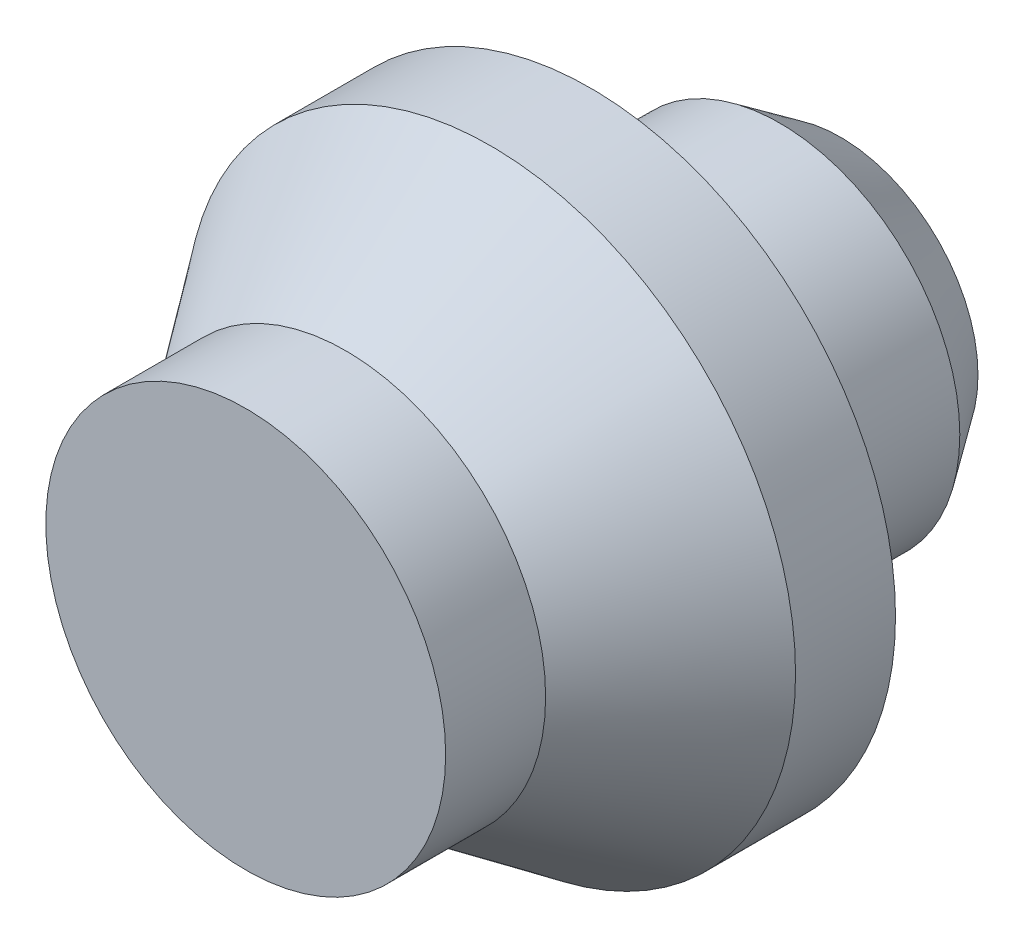
ISO-10303-21;
HEADER;
FILE_DESCRIPTION(('STEP AP214'),'2;1');
FILE_NAME('part.step','',(''),(''),'','','');
FILE_SCHEMA(('AUTOMOTIVE_DESIGN { 1 0 10303 214 1 1 1 1 }'));
ENDSEC;
DATA;
#1=APPLICATION_CONTEXT('core data for automotive mechanical design processes');
#2=APPLICATION_PROTOCOL_DEFINITION('international standard','automotive_design',2000,#1);
#3=PRODUCT_CONTEXT('',#1,'mechanical');
#4=PRODUCT('Part','Part','',(#3));
#5=PRODUCT_RELATED_PRODUCT_CATEGORY('part','',(#4));
#6=PRODUCT_DEFINITION_FORMATION('','',#4);
#7=PRODUCT_DEFINITION_CONTEXT('part definition',#1,'design');
#8=PRODUCT_DEFINITION('design','',#6,#7);
#9=PRODUCT_DEFINITION_SHAPE('','',#8);
#10=(LENGTH_UNIT() NAMED_UNIT(*) SI_UNIT(.MILLI.,.METRE.));
#11=(NAMED_UNIT(*) PLANE_ANGLE_UNIT() SI_UNIT($,.RADIAN.));
#12=(NAMED_UNIT(*) SI_UNIT($,.STERADIAN.) SOLID_ANGLE_UNIT());
#13=UNCERTAINTY_MEASURE_WITH_UNIT(LENGTH_MEASURE(1.E-05),#10,'distance_accuracy_value','');
#14=(GEOMETRIC_REPRESENTATION_CONTEXT(3) GLOBAL_UNCERTAINTY_ASSIGNED_CONTEXT((#13)) GLOBAL_UNIT_ASSIGNED_CONTEXT((#10,
#11,#12)) REPRESENTATION_CONTEXT('',''));
#15=CARTESIAN_POINT('',(0.,0.,0.));
#16=DIRECTION('',(0.,0.,1.));
#17=DIRECTION('',(1.,0.,0.));
#18=AXIS2_PLACEMENT_3D('',#15,#16,#17);
#19=CARTESIAN_POINT('',(4.,0.,0.));
#20=DIRECTION('',(0.,0.,1.));
#21=DIRECTION('',(1.,0.,0.));
#22=AXIS2_PLACEMENT_3D('',#19,#20,#21);
#23=PLANE('',#22);
#24=CARTESIAN_POINT('',(0.,0.,0.));
#25=DIRECTION('',(0.,0.,1.));
#26=DIRECTION('',(1.,0.,0.));
#27=AXIS2_PLACEMENT_3D('',#24,#25,#26);
#28=CIRCLE('',#27,4.);
#29=CARTESIAN_POINT('',(4.,0.,0.));
#30=VERTEX_POINT('',#29);
#31=EDGE_CURVE('E63',#30,#30,#28,.T.);
#32=ORIENTED_EDGE('',*,*,#31,.T.);
#33=EDGE_LOOP('',(#32));
#34=FACE_BOUND('',#33,.T.);
#35=ADVANCED_FACE('F32',(#34),#23,.T.);
#36=CARTESIAN_POINT('',(0.,0.,-11.9));
#37=DIRECTION('',(0.,0.,-1.));
#38=DIRECTION('',(-1.,0.,0.));
#39=AXIS2_PLACEMENT_3D('',#36,#37,#38);
#40=PLANE('',#39);
#41=CARTESIAN_POINT('',(0.,0.,-11.9));
#42=DIRECTION('',(0.,0.,1.));
#43=DIRECTION('',(1.,0.,0.));
#44=AXIS2_PLACEMENT_3D('',#41,#42,#43);
#45=CIRCLE('',#44,2.75);
#46=CARTESIAN_POINT('',(2.75,0.,-11.9));
#47=VERTEX_POINT('',#46);
#48=EDGE_CURVE('E10',#47,#47,#45,.T.);
#49=ORIENTED_EDGE('',*,*,#48,.F.);
#50=EDGE_LOOP('',(#49));
#51=FACE_BOUND('',#50,.T.);
#52=ADVANCED_FACE('F80',(#51),#40,.T.);
#53=CARTESIAN_POINT('',(0.,0.,-10.6860741942692));
#54=DIRECTION('',(0.,0.,1.));
#55=DIRECTION('',(1.,0.,0.));
#56=AXIS2_PLACEMENT_3D('',#53,#54,#55);
#57=CONICAL_SURFACE('',#56,3.6,0.610865238198018);
#58=ORIENTED_EDGE('',*,*,#48,.T.);
#59=EDGE_LOOP('',(#58));
#60=FACE_BOUND('',#59,.T.);
#61=CARTESIAN_POINT('',(0.,0.,-10.6860741942692));
#62=DIRECTION('',(0.,0.,1.));
#63=DIRECTION('',(1.,0.,0.));
#64=AXIS2_PLACEMENT_3D('',#61,#62,#63);
#65=CIRCLE('',#64,3.6);
#66=CARTESIAN_POINT('',(3.6,0.,-10.6860741942692));
#67=VERTEX_POINT('',#66);
#68=EDGE_CURVE('E39',#67,#67,#65,.T.);
#69=ORIENTED_EDGE('',*,*,#68,.F.);
#70=EDGE_LOOP('',(#69));
#71=FACE_BOUND('',#70,.T.);
#72=ADVANCED_FACE('F84',(#60,#71),#57,.T.);
#73=CARTESIAN_POINT('',(0.,0.,0.));
#74=DIRECTION('',(0.,0.,1.));
#75=DIRECTION('',(1.,0.,0.));
#76=AXIS2_PLACEMENT_3D('',#73,#74,#75);
#77=CYLINDRICAL_SURFACE('',#76,3.6);
#78=ORIENTED_EDGE('',*,*,#68,.T.);
#79=EDGE_LOOP('',(#78));
#80=FACE_BOUND('',#79,.T.);
#81=CARTESIAN_POINT('',(0.,0.,-6.9));
#82=DIRECTION('',(0.,0.,1.));
#83=DIRECTION('',(1.,0.,0.));
#84=AXIS2_PLACEMENT_3D('',#81,#82,#83);
#85=CIRCLE('',#84,3.6);
#86=CARTESIAN_POINT('',(3.6,0.,-6.9));
#87=VERTEX_POINT('',#86);
#88=EDGE_CURVE('E46',#87,#87,#85,.T.);
#89=ORIENTED_EDGE('',*,*,#88,.F.);
#90=EDGE_LOOP('',(#89));
#91=FACE_BOUND('',#90,.T.);
#92=ADVANCED_FACE('F89',(#80,#91),#77,.T.);
#93=CARTESIAN_POINT('',(3.6,0.,-6.9));
#94=DIRECTION('',(0.,0.,-1.));
#95=DIRECTION('',(-1.,0.,0.));
#96=AXIS2_PLACEMENT_3D('',#93,#94,#95);
#97=PLANE('',#96);
#98=ORIENTED_EDGE('',*,*,#88,.T.);
#99=EDGE_LOOP('',(#98));
#100=FACE_BOUND('',#99,.T.);
#101=CARTESIAN_POINT('',(0.,0.,-6.9));
#102=DIRECTION('',(0.,0.,1.));
#103=DIRECTION('',(1.,0.,0.));
#104=AXIS2_PLACEMENT_3D('',#101,#102,#103);
#105=CIRCLE('',#104,6.1);
#106=CARTESIAN_POINT('',(6.1,0.,-6.9));
#107=VERTEX_POINT('',#106);
#108=EDGE_CURVE('E51',#107,#107,#105,.T.);
#109=ORIENTED_EDGE('',*,*,#108,.F.);
#110=EDGE_LOOP('',(#109));
#111=FACE_BOUND('',#110,.T.);
#112=ADVANCED_FACE('F94',(#100,#111),#97,.T.);
#113=CARTESIAN_POINT('',(0.,0.,0.));
#114=DIRECTION('',(0.,0.,1.));
#115=DIRECTION('',(1.,0.,0.));
#116=AXIS2_PLACEMENT_3D('',#113,#114,#115);
#117=CYLINDRICAL_SURFACE('',#116,6.1);
#118=ORIENTED_EDGE('',*,*,#108,.T.);
#119=EDGE_LOOP('',(#118));
#120=FACE_BOUND('',#119,.T.);
#121=CARTESIAN_POINT('',(0.,0.,-4.9));
#122=DIRECTION('',(0.,0.,1.));
#123=DIRECTION('',(1.,0.,0.));
#124=AXIS2_PLACEMENT_3D('',#121,#122,#123);
#125=CIRCLE('',#124,6.1);
#126=CARTESIAN_POINT('',(6.1,0.,-4.9));
#127=VERTEX_POINT('',#126);
#128=EDGE_CURVE('E57',#127,#127,#125,.T.);
#129=ORIENTED_EDGE('',*,*,#128,.F.);
#130=EDGE_LOOP('',(#129));
#131=FACE_BOUND('',#130,.T.);
#132=ADVANCED_FACE('F76',(#120,#131),#117,.T.);
#133=CARTESIAN_POINT('',(0.,0.,-2.));
#134=DIRECTION('',(0.,0.,-1.));
#135=DIRECTION('',(-1.,0.,0.));
#136=AXIS2_PLACEMENT_3D('',#133,#134,#135);
#137=CONICAL_SURFACE('',#136,4.,0.626742901211047);
#138=ORIENTED_EDGE('',*,*,#128,.T.);
#139=EDGE_LOOP('',(#138));
#140=FACE_BOUND('',#139,.T.);
#141=CARTESIAN_POINT('',(0.,0.,-2.));
#142=DIRECTION('',(0.,0.,1.));
#143=DIRECTION('',(1.,0.,0.));
#144=AXIS2_PLACEMENT_3D('',#141,#142,#143);
#145=CIRCLE('',#144,4.);
#146=CARTESIAN_POINT('',(4.,0.,-2.));
#147=VERTEX_POINT('',#146);
#148=EDGE_CURVE('E60',#147,#147,#145,.T.);
#149=ORIENTED_EDGE('',*,*,#148,.F.);
#150=EDGE_LOOP('',(#149));
#151=FACE_BOUND('',#150,.T.);
#152=ADVANCED_FACE('F70',(#140,#151),#137,.T.);
#153=CARTESIAN_POINT('',(0.,0.,0.));
#154=DIRECTION('',(0.,0.,1.));
#155=DIRECTION('',(1.,0.,0.));
#156=AXIS2_PLACEMENT_3D('',#153,#154,#155);
#157=CYLINDRICAL_SURFACE('',#156,4.);
#158=ORIENTED_EDGE('',*,*,#148,.T.);
#159=EDGE_LOOP('',(#158));
#160=FACE_BOUND('',#159,.T.);
#161=ORIENTED_EDGE('',*,*,#31,.F.);
#162=EDGE_LOOP('',(#161));
#163=FACE_BOUND('',#162,.T.);
#164=ADVANCED_FACE('F68',(#160,#163),#157,.T.);
#165=CLOSED_SHELL('',(#35,#52,#72,#92,#112,#132,#152,#164));
#166=MANIFOLD_SOLID_BREP('B2',#165);
#167=ADVANCED_BREP_SHAPE_REPRESENTATION('',(#18,#166),#14);
#168=SHAPE_DEFINITION_REPRESENTATION(#9,#167);
ENDSEC;
END-ISO-10303-21;
